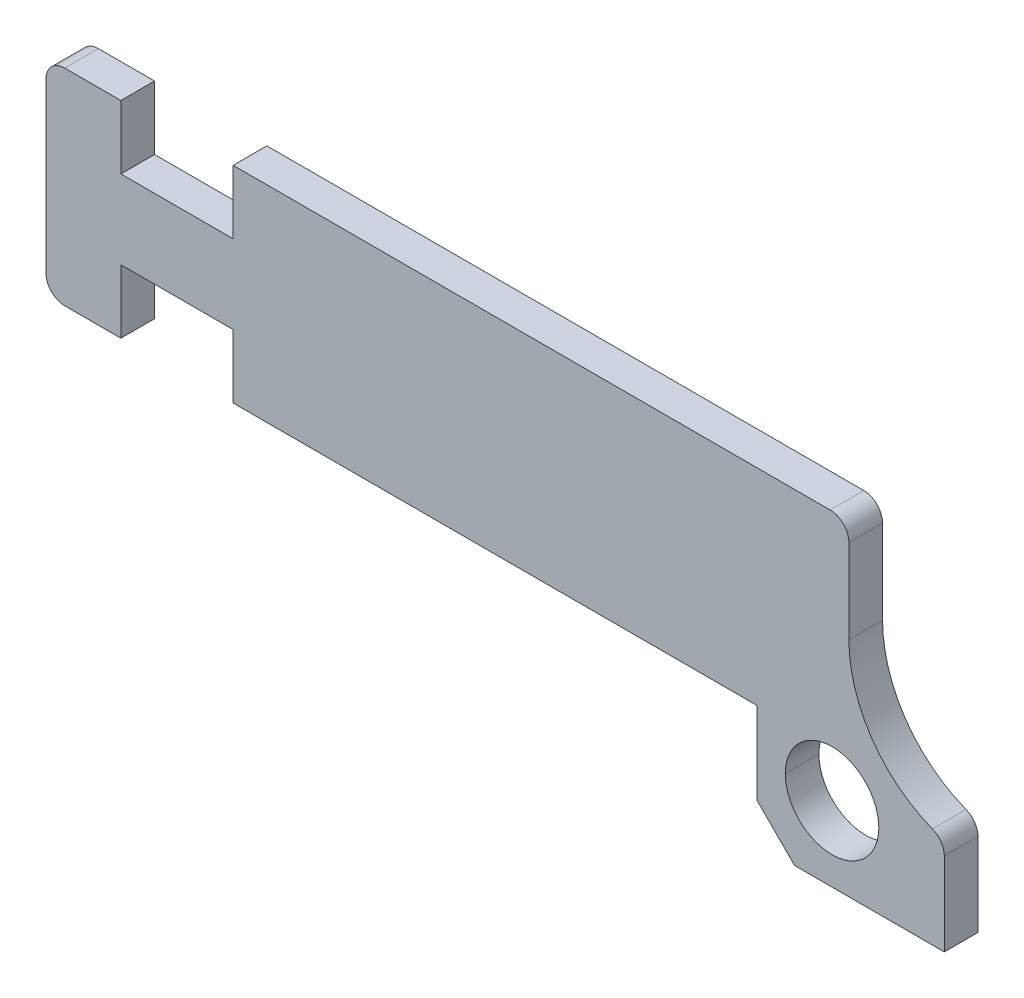
ISO-10303-21;
HEADER;
FILE_DESCRIPTION(('STEP AP214'),'2;1');
FILE_NAME('part.step','',(''),(''),'','','');
FILE_SCHEMA(('AUTOMOTIVE_DESIGN { 1 0 10303 214 1 1 1 1 }'));
ENDSEC;
DATA;
#1=APPLICATION_CONTEXT('core data for automotive mechanical design processes');
#2=APPLICATION_PROTOCOL_DEFINITION('international standard','automotive_design',2000,#1);
#3=PRODUCT_CONTEXT('',#1,'mechanical');
#4=PRODUCT('Part','Part','',(#3));
#5=PRODUCT_RELATED_PRODUCT_CATEGORY('part','',(#4));
#6=PRODUCT_DEFINITION_FORMATION('','',#4);
#7=PRODUCT_DEFINITION_CONTEXT('part definition',#1,'design');
#8=PRODUCT_DEFINITION('design','',#6,#7);
#9=PRODUCT_DEFINITION_SHAPE('','',#8);
#10=(LENGTH_UNIT() NAMED_UNIT(*) SI_UNIT(.MILLI.,.METRE.));
#11=(NAMED_UNIT(*) PLANE_ANGLE_UNIT() SI_UNIT($,.RADIAN.));
#12=(NAMED_UNIT(*) SI_UNIT($,.STERADIAN.) SOLID_ANGLE_UNIT());
#13=UNCERTAINTY_MEASURE_WITH_UNIT(LENGTH_MEASURE(1.E-05),#10,'distance_accuracy_value','');
#14=(GEOMETRIC_REPRESENTATION_CONTEXT(3) GLOBAL_UNCERTAINTY_ASSIGNED_CONTEXT((#13)) GLOBAL_UNIT_ASSIGNED_CONTEXT((#10,
#11,#12)) REPRESENTATION_CONTEXT('',''));
#15=CARTESIAN_POINT('',(0.,0.,0.));
#16=DIRECTION('',(0.,0.,1.));
#17=DIRECTION('',(1.,0.,0.));
#18=AXIS2_PLACEMENT_3D('',#15,#16,#17);
#19=CARTESIAN_POINT('',(-3.95,-3.95,0.9));
#20=DIRECTION('',(0.,0.,1.));
#21=DIRECTION('',(1.,0.,0.));
#22=AXIS2_PLACEMENT_3D('',#19,#20,#21);
#23=CYLINDRICAL_SURFACE('',#22,1.25);
#24=DIRECTION('',(0.,0.,1.));
#25=VECTOR('',#24,1.);
#26=CARTESIAN_POINT('',(-5.2,-3.95,0.9));
#27=LINE('',#26,#25);
#28=CARTESIAN_POINT('',(-5.2,-3.95,0.));
#29=VERTEX_POINT('',#28);
#30=CARTESIAN_POINT('',(-5.2,-3.95,0.9));
#31=VERTEX_POINT('',#30);
#32=EDGE_CURVE('E371',#29,#31,#27,.T.);
#33=ORIENTED_EDGE('',*,*,#32,.F.);
#34=CARTESIAN_POINT('',(-3.95,-3.95,0.));
#35=DIRECTION('',(0.,0.,1.));
#36=DIRECTION('',(1.,0.,0.));
#37=AXIS2_PLACEMENT_3D('',#34,#35,#36);
#38=CIRCLE('',#37,1.25);
#39=CARTESIAN_POINT('',(-2.7,-3.95,0.));
#40=VERTEX_POINT('',#39);
#41=EDGE_CURVE('E324',#40,#29,#38,.T.);
#42=ORIENTED_EDGE('',*,*,#41,.F.);
#43=DIRECTION('',(0.,0.,1.));
#44=VECTOR('',#43,1.);
#45=CARTESIAN_POINT('',(-2.7,-3.95,0.9));
#46=LINE('',#45,#44);
#47=CARTESIAN_POINT('',(-2.7,-3.95,0.9));
#48=VERTEX_POINT('',#47);
#49=EDGE_CURVE('E289',#40,#48,#46,.T.);
#50=ORIENTED_EDGE('',*,*,#49,.T.);
#51=CARTESIAN_POINT('',(-3.95,-3.95,0.9));
#52=DIRECTION('',(0.,0.,1.));
#53=DIRECTION('',(1.,0.,0.));
#54=AXIS2_PLACEMENT_3D('',#51,#52,#53);
#55=CIRCLE('',#54,1.25);
#56=EDGE_CURVE('E11',#48,#31,#55,.T.);
#57=ORIENTED_EDGE('',*,*,#56,.T.);
#58=EDGE_LOOP('',(#33,#42,#50,#57));
#59=FACE_BOUND('',#58,.T.);
#60=ADVANCED_FACE('F17',(#59),#23,.F.);
#61=CARTESIAN_POINT('',(-12.48691210598,-0.852250789584,0.9));
#62=DIRECTION('',(0.,0.,1.));
#63=DIRECTION('',(1.,0.,0.));
#64=AXIS2_PLACEMENT_3D('',#61,#62,#63);
#65=PLANE('',#64);
#66=ORIENTED_EDGE('',*,*,#56,.F.);
#67=CARTESIAN_POINT('',(-3.95,-3.95,0.9));
#68=DIRECTION('',(0.,0.,1.));
#69=DIRECTION('',(1.,0.,0.));
#70=AXIS2_PLACEMENT_3D('',#67,#68,#69);
#71=CIRCLE('',#70,1.25);
#72=EDGE_CURVE('E294',#31,#48,#71,.T.);
#73=ORIENTED_EDGE('',*,*,#72,.F.);
#74=EDGE_LOOP('',(#66,#73));
#75=FACE_BOUND('',#74,.T.);
#76=DIRECTION('',(0.,1.,0.));
#77=VECTOR('',#76,1.);
#78=CARTESIAN_POINT('',(-5.95,-5.95,0.9));
#79=LINE('',#78,#77);
#80=CARTESIAN_POINT('',(-5.95,-4.95,0.9));
#81=VERTEX_POINT('',#80);
#82=CARTESIAN_POINT('',(-5.95,-2.75,0.9));
#83=VERTEX_POINT('',#82);
#84=EDGE_CURVE('E367',#81,#83,#79,.T.);
#85=ORIENTED_EDGE('',*,*,#84,.F.);
#86=DIRECTION('',(0.707106781186548,-0.707106781186548,0.));
#87=VECTOR('',#86,1.);
#88=CARTESIAN_POINT('',(-8.3586653291,-2.5413346709,0.9));
#89=LINE('',#88,#87);
#90=CARTESIAN_POINT('',(-4.95,-5.95,0.9));
#91=VERTEX_POINT('',#90);
#92=EDGE_CURVE('E282',#81,#91,#89,.T.);
#93=ORIENTED_EDGE('',*,*,#92,.T.);
#94=DIRECTION('',(-1.,0.,0.));
#95=VECTOR('',#94,1.);
#96=CARTESIAN_POINT('',(-0.95,-5.95,0.9));
#97=LINE('',#96,#95);
#98=CARTESIAN_POINT('',(-0.95,-5.95,0.9));
#99=VERTEX_POINT('',#98);
#100=EDGE_CURVE('E295',#99,#91,#97,.T.);
#101=ORIENTED_EDGE('',*,*,#100,.F.);
#102=DIRECTION('',(0.,-1.,0.));
#103=VECTOR('',#102,1.);
#104=CARTESIAN_POINT('',(-0.95,-3.727935085272,0.9));
#105=LINE('',#104,#103);
#106=CARTESIAN_POINT('',(-0.95,-3.727935085272,0.9));
#107=VERTEX_POINT('',#106);
#108=EDGE_CURVE('E246',#107,#99,#105,.T.);
#109=ORIENTED_EDGE('',*,*,#108,.F.);
#110=CARTESIAN_POINT('',(-1.45,-3.727935085272,0.9));
#111=DIRECTION('',(0.,0.,1.));
#112=DIRECTION('',(1.,0.,0.));
#113=AXIS2_PLACEMENT_3D('',#110,#111,#112);
#114=CIRCLE('',#113,0.5);
#115=CARTESIAN_POINT('',(-1.26875,-3.261943199613,0.9));
#116=VERTEX_POINT('',#115);
#117=EDGE_CURVE('E242',#107,#116,#114,.T.);
#118=ORIENTED_EDGE('',*,*,#117,.T.);
#119=CARTESIAN_POINT('',(0.,0.,0.9));
#120=DIRECTION('',(0.,0.,1.));
#121=DIRECTION('',(1.,0.,0.));
#122=AXIS2_PLACEMENT_3D('',#119,#120,#121);
#123=CIRCLE('',#122,3.5);
#124=CARTESIAN_POINT('',(-3.5,0.,0.9));
#125=VERTEX_POINT('',#124);
#126=EDGE_CURVE('E303',#125,#116,#123,.T.);
#127=ORIENTED_EDGE('',*,*,#126,.F.);
#128=DIRECTION('',(0.,-1.,0.));
#129=VECTOR('',#128,1.);
#130=CARTESIAN_POINT('',(-3.5,2.25,0.9));
#131=LINE('',#130,#129);
#132=CARTESIAN_POINT('',(-3.5,2.25,0.9));
#133=VERTEX_POINT('',#132);
#134=EDGE_CURVE('E21',#133,#125,#131,.T.);
#135=ORIENTED_EDGE('',*,*,#134,.F.);
#136=CARTESIAN_POINT('',(-4.,2.25,0.9));
#137=DIRECTION('',(0.,0.,1.));
#138=DIRECTION('',(1.,0.,0.));
#139=AXIS2_PLACEMENT_3D('',#136,#137,#138);
#140=CIRCLE('',#139,0.5);
#141=CARTESIAN_POINT('',(-4.,2.75,0.9));
#142=VERTEX_POINT('',#141);
#143=EDGE_CURVE('E309',#133,#142,#140,.T.);
#144=ORIENTED_EDGE('',*,*,#143,.T.);
#145=DIRECTION('',(1.,0.,0.));
#146=VECTOR('',#145,1.);
#147=CARTESIAN_POINT('',(-24.95,2.75,0.9));
#148=LINE('',#147,#146);
#149=CARTESIAN_POINT('',(-19.95,2.75,0.9));
#150=VERTEX_POINT('',#149);
#151=EDGE_CURVE('E397',#150,#142,#148,.T.);
#152=ORIENTED_EDGE('',*,*,#151,.F.);
#153=DIRECTION('',(0.,-1.,0.));
#154=VECTOR('',#153,1.);
#155=CARTESIAN_POINT('',(-19.95,2.75,0.9));
#156=LINE('',#155,#154);
#157=CARTESIAN_POINT('',(-19.95,1.05,0.9));
#158=VERTEX_POINT('',#157);
#159=EDGE_CURVE('E322',#150,#158,#156,.T.);
#160=ORIENTED_EDGE('',*,*,#159,.T.);
#161=DIRECTION('',(-1.,0.,0.));
#162=VECTOR('',#161,1.);
#163=CARTESIAN_POINT('',(-19.95,1.05,0.9));
#164=LINE('',#163,#162);
#165=CARTESIAN_POINT('',(-22.95,1.05,0.9));
#166=VERTEX_POINT('',#165);
#167=EDGE_CURVE('E407',#158,#166,#164,.T.);
#168=ORIENTED_EDGE('',*,*,#167,.T.);
#169=DIRECTION('',(0.,1.,0.));
#170=VECTOR('',#169,1.);
#171=CARTESIAN_POINT('',(-22.95,1.05,0.9));
#172=LINE('',#171,#170);
#173=CARTESIAN_POINT('',(-22.95,2.75,0.9));
#174=VERTEX_POINT('',#173);
#175=EDGE_CURVE('E28',#166,#174,#172,.T.);
#176=ORIENTED_EDGE('',*,*,#175,.T.);
#177=DIRECTION('',(1.,0.,0.));
#178=VECTOR('',#177,1.);
#179=CARTESIAN_POINT('',(-24.95,2.75,0.9));
#180=LINE('',#179,#178);
#181=CARTESIAN_POINT('',(-24.45,2.75,0.9));
#182=VERTEX_POINT('',#181);
#183=EDGE_CURVE('E375',#182,#174,#180,.T.);
#184=ORIENTED_EDGE('',*,*,#183,.F.);
#185=CARTESIAN_POINT('',(-24.45,2.25,0.9));
#186=DIRECTION('',(0.,0.,-1.));
#187=DIRECTION('',(0.,-1.,0.));
#188=AXIS2_PLACEMENT_3D('',#185,#186,#187);
#189=CIRCLE('',#188,0.5);
#190=CARTESIAN_POINT('',(-24.95,2.25,0.9));
#191=VERTEX_POINT('',#190);
#192=EDGE_CURVE('E323',#191,#182,#189,.T.);
#193=ORIENTED_EDGE('',*,*,#192,.F.);
#194=DIRECTION('',(0.,-1.,0.));
#195=VECTOR('',#194,1.);
#196=CARTESIAN_POINT('',(-24.95,2.75,0.9));
#197=LINE('',#196,#195);
#198=CARTESIAN_POINT('',(-24.95,-2.25,0.9));
#199=VERTEX_POINT('',#198);
#200=EDGE_CURVE('E312',#191,#199,#197,.T.);
#201=ORIENTED_EDGE('',*,*,#200,.T.);
#202=CARTESIAN_POINT('',(-24.45,-2.25,0.9));
#203=DIRECTION('',(0.,0.,-1.));
#204=DIRECTION('',(0.,-1.,0.));
#205=AXIS2_PLACEMENT_3D('',#202,#203,#204);
#206=CIRCLE('',#205,0.5);
#207=CARTESIAN_POINT('',(-24.45,-2.75,0.9));
#208=VERTEX_POINT('',#207);
#209=EDGE_CURVE('E386',#208,#199,#206,.T.);
#210=ORIENTED_EDGE('',*,*,#209,.F.);
#211=DIRECTION('',(-1.,0.,0.));
#212=VECTOR('',#211,1.);
#213=CARTESIAN_POINT('',(-5.95,-2.75,0.9));
#214=LINE('',#213,#212);
#215=CARTESIAN_POINT('',(-22.95,-2.75,0.9));
#216=VERTEX_POINT('',#215);
#217=EDGE_CURVE('E308',#216,#208,#214,.T.);
#218=ORIENTED_EDGE('',*,*,#217,.F.);
#219=DIRECTION('',(0.,-1.,0.));
#220=VECTOR('',#219,1.);
#221=CARTESIAN_POINT('',(-22.95,-1.049999999973,0.9));
#222=LINE('',#221,#220);
#223=CARTESIAN_POINT('',(-22.95,-1.049999999973,0.9));
#224=VERTEX_POINT('',#223);
#225=EDGE_CURVE('E304',#224,#216,#222,.T.);
#226=ORIENTED_EDGE('',*,*,#225,.F.);
#227=DIRECTION('',(-1.,0.,0.));
#228=VECTOR('',#227,1.);
#229=CARTESIAN_POINT('',(-19.95,-1.049999999973,0.9));
#230=LINE('',#229,#228);
#231=CARTESIAN_POINT('',(-19.95,-1.049999999973,0.9));
#232=VERTEX_POINT('',#231);
#233=EDGE_CURVE('E354',#232,#224,#230,.T.);
#234=ORIENTED_EDGE('',*,*,#233,.F.);
#235=DIRECTION('',(0.,1.,0.));
#236=VECTOR('',#235,1.);
#237=CARTESIAN_POINT('',(-19.95,-2.75,0.9));
#238=LINE('',#237,#236);
#239=CARTESIAN_POINT('',(-19.95,-2.75,0.9));
#240=VERTEX_POINT('',#239);
#241=EDGE_CURVE('E247',#240,#232,#238,.T.);
#242=ORIENTED_EDGE('',*,*,#241,.F.);
#243=DIRECTION('',(-1.,0.,0.));
#244=VECTOR('',#243,1.);
#245=CARTESIAN_POINT('',(-5.95,-2.75,0.9));
#246=LINE('',#245,#244);
#247=EDGE_CURVE('E277',#83,#240,#246,.T.);
#248=ORIENTED_EDGE('',*,*,#247,.F.);
#249=EDGE_LOOP('',(#85,#93,#101,#109,#118,#127,#135,#144,#152,#160,#168,#176,#184,#193,#201,
#210,#218,#226,#234,#242,#248));
#250=FACE_BOUND('',#249,.T.);
#251=ADVANCED_FACE('F450',(#75,#250),#65,.T.);
#252=CARTESIAN_POINT('',(-22.95,1.05,0.9));
#253=DIRECTION('',(1.,0.,0.));
#254=DIRECTION('',(0.,1.,0.));
#255=AXIS2_PLACEMENT_3D('',#252,#253,#254);
#256=PLANE('',#255);
#257=ORIENTED_EDGE('',*,*,#175,.F.);
#258=DIRECTION('',(0.,0.,-1.));
#259=VECTOR('',#258,1.);
#260=CARTESIAN_POINT('',(-22.95,1.05,0.9));
#261=LINE('',#260,#259);
#262=CARTESIAN_POINT('',(-22.95,1.05,0.));
#263=VERTEX_POINT('',#262);
#264=EDGE_CURVE('E351',#166,#263,#261,.T.);
#265=ORIENTED_EDGE('',*,*,#264,.T.);
#266=DIRECTION('',(0.,1.,0.));
#267=VECTOR('',#266,1.);
#268=CARTESIAN_POINT('',(-22.95,0.09887460520782,0.));
#269=LINE('',#268,#267);
#270=CARTESIAN_POINT('',(-22.95,2.75,0.));
#271=VERTEX_POINT('',#270);
#272=EDGE_CURVE('E429',#263,#271,#269,.T.);
#273=ORIENTED_EDGE('',*,*,#272,.T.);
#274=DIRECTION('',(0.,0.,-1.));
#275=VECTOR('',#274,1.);
#276=CARTESIAN_POINT('',(-22.95,2.75,0.9));
#277=LINE('',#276,#275);
#278=EDGE_CURVE('E404',#174,#271,#277,.T.);
#279=ORIENTED_EDGE('',*,*,#278,.F.);
#280=EDGE_LOOP('',(#257,#265,#273,#279));
#281=FACE_BOUND('',#280,.T.);
#282=ADVANCED_FACE('F464',(#281),#256,.T.);
#283=CARTESIAN_POINT('',(-19.95,1.05,0.9));
#284=DIRECTION('',(0.,1.,0.));
#285=DIRECTION('',(1.,0.,0.));
#286=AXIS2_PLACEMENT_3D('',#283,#284,#285);
#287=PLANE('',#286);
#288=ORIENTED_EDGE('',*,*,#167,.F.);
#289=DIRECTION('',(0.,0.,-1.));
#290=VECTOR('',#289,1.);
#291=CARTESIAN_POINT('',(-19.95,1.05,0.9));
#292=LINE('',#291,#290);
#293=CARTESIAN_POINT('',(-19.95,1.05,0.));
#294=VERTEX_POINT('',#293);
#295=EDGE_CURVE('E372',#158,#294,#292,.T.);
#296=ORIENTED_EDGE('',*,*,#295,.T.);
#297=DIRECTION('',(-1.,0.,0.));
#298=VECTOR('',#297,1.);
#299=CARTESIAN_POINT('',(-16.21845605299,1.05,0.));
#300=LINE('',#299,#298);
#301=EDGE_CURVE('E432',#294,#263,#300,.T.);
#302=ORIENTED_EDGE('',*,*,#301,.T.);
#303=ORIENTED_EDGE('',*,*,#264,.F.);
#304=EDGE_LOOP('',(#288,#296,#302,#303));
#305=FACE_BOUND('',#304,.T.);
#306=ADVANCED_FACE('F462',(#305),#287,.T.);
#307=CARTESIAN_POINT('',(-24.95,2.75,0.));
#308=DIRECTION('',(0.,1.,0.));
#309=DIRECTION('',(1.,0.,0.));
#310=AXIS2_PLACEMENT_3D('',#307,#308,#309);
#311=PLANE('',#310);
#312=DIRECTION('',(1.,0.,0.));
#313=VECTOR('',#312,1.);
#314=CARTESIAN_POINT('',(-24.95,2.75,0.));
#315=LINE('',#314,#313);
#316=CARTESIAN_POINT('',(-24.45,2.75,0.));
#317=VERTEX_POINT('',#316);
#318=EDGE_CURVE('E380',#317,#271,#315,.T.);
#319=ORIENTED_EDGE('',*,*,#318,.F.);
#320=DIRECTION('',(0.,0.,1.));
#321=VECTOR('',#320,1.);
#322=CARTESIAN_POINT('',(-24.45,2.75,0.));
#323=LINE('',#322,#321);
#324=EDGE_CURVE('E318',#317,#182,#323,.T.);
#325=ORIENTED_EDGE('',*,*,#324,.T.);
#326=ORIENTED_EDGE('',*,*,#183,.T.);
#327=ORIENTED_EDGE('',*,*,#278,.T.);
#328=EDGE_LOOP('',(#319,#325,#326,#327));
#329=FACE_BOUND('',#328,.T.);
#330=ADVANCED_FACE('F834',(#329),#311,.T.);
#331=CARTESIAN_POINT('',(-19.95,2.75,0.9));
#332=DIRECTION('',(-1.,0.,0.));
#333=DIRECTION('',(0.,0.,1.));
#334=AXIS2_PLACEMENT_3D('',#331,#332,#333);
#335=PLANE('',#334);
#336=ORIENTED_EDGE('',*,*,#159,.F.);
#337=DIRECTION('',(0.,0.,-1.));
#338=VECTOR('',#337,1.);
#339=CARTESIAN_POINT('',(-19.95,2.75,0.9));
#340=LINE('',#339,#338);
#341=CARTESIAN_POINT('',(-19.95,2.75,0.));
#342=VERTEX_POINT('',#341);
#343=EDGE_CURVE('E274',#150,#342,#340,.T.);
#344=ORIENTED_EDGE('',*,*,#343,.T.);
#345=DIRECTION('',(0.,-1.,0.));
#346=VECTOR('',#345,1.);
#347=CARTESIAN_POINT('',(-19.95,0.948874605208,0.));
#348=LINE('',#347,#346);
#349=EDGE_CURVE('E458',#342,#294,#348,.T.);
#350=ORIENTED_EDGE('',*,*,#349,.T.);
#351=ORIENTED_EDGE('',*,*,#295,.F.);
#352=EDGE_LOOP('',(#336,#344,#350,#351));
#353=FACE_BOUND('',#352,.T.);
#354=ADVANCED_FACE('F454',(#353),#335,.T.);
#355=CARTESIAN_POINT('',(-24.45,2.25,0.));
#356=DIRECTION('',(0.,0.,1.));
#357=DIRECTION('',(-1.,0.,0.));
#358=AXIS2_PLACEMENT_3D('',#355,#356,#357);
#359=CYLINDRICAL_SURFACE('',#358,0.5);
#360=DIRECTION('',(0.,0.,1.));
#361=VECTOR('',#360,1.);
#362=CARTESIAN_POINT('',(-24.95,2.25,0.));
#363=LINE('',#362,#361);
#364=CARTESIAN_POINT('',(-24.95,2.25,0.));
#365=VERTEX_POINT('',#364);
#366=EDGE_CURVE('E317',#365,#191,#363,.T.);
#367=ORIENTED_EDGE('',*,*,#366,.T.);
#368=ORIENTED_EDGE('',*,*,#192,.T.);
#369=ORIENTED_EDGE('',*,*,#324,.F.);
#370=CARTESIAN_POINT('',(-24.45,2.25,0.));
#371=DIRECTION('',(0.,0.,-1.));
#372=DIRECTION('',(0.,-1.,0.));
#373=AXIS2_PLACEMENT_3D('',#370,#371,#372);
#374=CIRCLE('',#373,0.5);
#375=EDGE_CURVE('E376',#365,#317,#374,.T.);
#376=ORIENTED_EDGE('',*,*,#375,.F.);
#377=EDGE_LOOP('',(#367,#368,#369,#376));
#378=FACE_BOUND('',#377,.T.);
#379=ADVANCED_FACE('F715',(#378),#359,.T.);
#380=CARTESIAN_POINT('',(-24.95,2.75,0.));
#381=DIRECTION('',(0.,1.,0.));
#382=DIRECTION('',(1.,0.,0.));
#383=AXIS2_PLACEMENT_3D('',#380,#381,#382);
#384=PLANE('',#383);
#385=DIRECTION('',(1.,0.,0.));
#386=VECTOR('',#385,1.);
#387=CARTESIAN_POINT('',(-24.95,2.75,0.));
#388=LINE('',#387,#386);
#389=CARTESIAN_POINT('',(-4.,2.75,0.));
#390=VERTEX_POINT('',#389);
#391=EDGE_CURVE('E422',#342,#390,#388,.T.);
#392=ORIENTED_EDGE('',*,*,#391,.F.);
#393=ORIENTED_EDGE('',*,*,#343,.F.);
#394=ORIENTED_EDGE('',*,*,#151,.T.);
#395=DIRECTION('',(0.,0.,1.));
#396=VECTOR('',#395,1.);
#397=CARTESIAN_POINT('',(-4.,2.75,0.));
#398=LINE('',#397,#396);
#399=EDGE_CURVE('E313',#390,#142,#398,.T.);
#400=ORIENTED_EDGE('',*,*,#399,.F.);
#401=EDGE_LOOP('',(#392,#393,#394,#400));
#402=FACE_BOUND('',#401,.T.);
#403=ADVANCED_FACE('F710',(#402),#384,.T.);
#404=CARTESIAN_POINT('',(-24.95,2.75,0.));
#405=DIRECTION('',(1.,0.,0.));
#406=DIRECTION('',(0.,1.,0.));
#407=AXIS2_PLACEMENT_3D('',#404,#405,#406);
#408=PLANE('',#407);
#409=DIRECTION('',(0.,0.,1.));
#410=VECTOR('',#409,1.);
#411=CARTESIAN_POINT('',(-24.95,-2.25,0.));
#412=LINE('',#411,#410);
#413=CARTESIAN_POINT('',(-24.95,-2.25,0.));
#414=VERTEX_POINT('',#413);
#415=EDGE_CURVE('E382',#414,#199,#412,.T.);
#416=ORIENTED_EDGE('',*,*,#415,.T.);
#417=ORIENTED_EDGE('',*,*,#200,.F.);
#418=ORIENTED_EDGE('',*,*,#366,.F.);
#419=DIRECTION('',(0.,-1.,0.));
#420=VECTOR('',#419,1.);
#421=CARTESIAN_POINT('',(-24.95,2.75,0.));
#422=LINE('',#421,#420);
#423=EDGE_CURVE('E381',#365,#414,#422,.T.);
#424=ORIENTED_EDGE('',*,*,#423,.T.);
#425=EDGE_LOOP('',(#416,#417,#418,#424));
#426=FACE_BOUND('',#425,.T.);
#427=ADVANCED_FACE('F714',(#426),#408,.F.);
#428=CARTESIAN_POINT('',(-4.,2.25,0.));
#429=DIRECTION('',(0.,0.,-1.));
#430=DIRECTION('',(1.,0.,0.));
#431=AXIS2_PLACEMENT_3D('',#428,#429,#430);
#432=CYLINDRICAL_SURFACE('',#431,0.5);
#433=CARTESIAN_POINT('',(-4.,2.25,0.));
#434=DIRECTION('',(0.,0.,1.));
#435=DIRECTION('',(1.,0.,0.));
#436=AXIS2_PLACEMENT_3D('',#433,#434,#435);
#437=CIRCLE('',#436,0.5);
#438=CARTESIAN_POINT('',(-3.5,2.25,0.));
#439=VERTEX_POINT('',#438);
#440=EDGE_CURVE('E418',#439,#390,#437,.T.);
#441=ORIENTED_EDGE('',*,*,#440,.T.);
#442=ORIENTED_EDGE('',*,*,#399,.T.);
#443=ORIENTED_EDGE('',*,*,#143,.F.);
#444=DIRECTION('',(0.,0.,1.));
#445=VECTOR('',#444,1.);
#446=CARTESIAN_POINT('',(-3.5,2.25,0.));
#447=LINE('',#446,#445);
#448=EDGE_CURVE('E348',#439,#133,#447,.T.);
#449=ORIENTED_EDGE('',*,*,#448,.F.);
#450=EDGE_LOOP('',(#441,#442,#443,#449));
#451=FACE_BOUND('',#450,.T.);
#452=ADVANCED_FACE('F764',(#451),#432,.T.);
#453=CARTESIAN_POINT('',(-24.45,-2.25,0.));
#454=DIRECTION('',(0.,0.,1.));
#455=DIRECTION('',(0.,-1.,0.));
#456=AXIS2_PLACEMENT_3D('',#453,#454,#455);
#457=CYLINDRICAL_SURFACE('',#456,0.5);
#458=DIRECTION('',(0.,0.,1.));
#459=VECTOR('',#458,1.);
#460=CARTESIAN_POINT('',(-24.45,-2.75,0.));
#461=LINE('',#460,#459);
#462=CARTESIAN_POINT('',(-24.45,-2.75,0.));
#463=VERTEX_POINT('',#462);
#464=EDGE_CURVE('E214',#463,#208,#461,.T.);
#465=ORIENTED_EDGE('',*,*,#464,.T.);
#466=ORIENTED_EDGE('',*,*,#209,.T.);
#467=ORIENTED_EDGE('',*,*,#415,.F.);
#468=CARTESIAN_POINT('',(-24.45,-2.25,0.));
#469=DIRECTION('',(0.,0.,-1.));
#470=DIRECTION('',(0.,-1.,0.));
#471=AXIS2_PLACEMENT_3D('',#468,#469,#470);
#472=CIRCLE('',#471,0.5);
#473=EDGE_CURVE('E437',#463,#414,#472,.T.);
#474=ORIENTED_EDGE('',*,*,#473,.F.);
#475=EDGE_LOOP('',(#465,#466,#467,#474));
#476=FACE_BOUND('',#475,.T.);
#477=ADVANCED_FACE('F768',(#476),#457,.T.);
#478=CARTESIAN_POINT('',(-3.5,2.25,0.));
#479=DIRECTION('',(1.,0.,0.));
#480=DIRECTION('',(0.,1.,0.));
#481=AXIS2_PLACEMENT_3D('',#478,#479,#480);
#482=PLANE('',#481);
#483=ORIENTED_EDGE('',*,*,#448,.T.);
#484=ORIENTED_EDGE('',*,*,#134,.T.);
#485=DIRECTION('',(0.,0.,1.));
#486=VECTOR('',#485,1.);
#487=CARTESIAN_POINT('',(-3.5,0.,0.));
#488=LINE('',#487,#486);
#489=CARTESIAN_POINT('',(-3.5,0.,0.));
#490=VERTEX_POINT('',#489);
#491=EDGE_CURVE('E299',#490,#125,#488,.T.);
#492=ORIENTED_EDGE('',*,*,#491,.F.);
#493=DIRECTION('',(0.,-1.,0.));
#494=VECTOR('',#493,1.);
#495=CARTESIAN_POINT('',(-3.5,2.25,0.));
#496=LINE('',#495,#494);
#497=EDGE_CURVE('E271',#439,#490,#496,.T.);
#498=ORIENTED_EDGE('',*,*,#497,.F.);
#499=EDGE_LOOP('',(#483,#484,#492,#498));
#500=FACE_BOUND('',#499,.T.);
#501=ADVANCED_FACE('F774',(#500),#482,.T.);
#502=CARTESIAN_POINT('',(-5.95,-2.75,0.));
#503=DIRECTION('',(0.,-1.,0.));
#504=DIRECTION('',(0.,0.,-1.));
#505=AXIS2_PLACEMENT_3D('',#502,#503,#504);
#506=PLANE('',#505);
#507=DIRECTION('',(-1.,0.,0.));
#508=VECTOR('',#507,1.);
#509=CARTESIAN_POINT('',(-5.95,-2.75,0.));
#510=LINE('',#509,#508);
#511=CARTESIAN_POINT('',(-22.95,-2.75,0.));
#512=VERTEX_POINT('',#511);
#513=EDGE_CURVE('E287',#512,#463,#510,.T.);
#514=ORIENTED_EDGE('',*,*,#513,.F.);
#515=DIRECTION('',(0.,0.,-1.));
#516=VECTOR('',#515,1.);
#517=CARTESIAN_POINT('',(-22.95,-2.75,0.9));
#518=LINE('',#517,#516);
#519=EDGE_CURVE('E202',#216,#512,#518,.T.);
#520=ORIENTED_EDGE('',*,*,#519,.F.);
#521=ORIENTED_EDGE('',*,*,#217,.T.);
#522=ORIENTED_EDGE('',*,*,#464,.F.);
#523=EDGE_LOOP('',(#514,#520,#521,#522));
#524=FACE_BOUND('',#523,.T.);
#525=ADVANCED_FACE('F750',(#524),#506,.T.);
#526=CARTESIAN_POINT('',(0.,0.,0.));
#527=DIRECTION('',(0.,0.,-1.));
#528=DIRECTION('',(1.,0.,0.));
#529=AXIS2_PLACEMENT_3D('',#526,#527,#528);
#530=CYLINDRICAL_SURFACE('',#529,3.5);
#531=ORIENTED_EDGE('',*,*,#491,.T.);
#532=ORIENTED_EDGE('',*,*,#126,.T.);
#533=DIRECTION('',(0.,0.,1.));
#534=VECTOR('',#533,1.);
#535=CARTESIAN_POINT('',(-1.26875,-3.261943199613,0.));
#536=LINE('',#535,#534);
#537=CARTESIAN_POINT('',(-1.26875,-3.261943199613,0.));
#538=VERTEX_POINT('',#537);
#539=EDGE_CURVE('E336',#538,#116,#536,.T.);
#540=ORIENTED_EDGE('',*,*,#539,.F.);
#541=CARTESIAN_POINT('',(0.,0.,0.));
#542=DIRECTION('',(0.,0.,1.));
#543=DIRECTION('',(1.,0.,0.));
#544=AXIS2_PLACEMENT_3D('',#541,#542,#543);
#545=CIRCLE('',#544,3.5);
#546=EDGE_CURVE('E264',#490,#538,#545,.T.);
#547=ORIENTED_EDGE('',*,*,#546,.F.);
#548=EDGE_LOOP('',(#531,#532,#540,#547));
#549=FACE_BOUND('',#548,.T.);
#550=ADVANCED_FACE('F745',(#549),#530,.F.);
#551=CARTESIAN_POINT('',(-22.95,-1.049999999973,0.9));
#552=DIRECTION('',(-1.,0.,0.));
#553=DIRECTION('',(0.,0.,1.));
#554=AXIS2_PLACEMENT_3D('',#551,#552,#553);
#555=PLANE('',#554);
#556=ORIENTED_EDGE('',*,*,#519,.T.);
#557=DIRECTION('',(0.,-1.,0.));
#558=VECTOR('',#557,1.);
#559=CARTESIAN_POINT('',(-22.95,-0.951125394779,0.));
#560=LINE('',#559,#558);
#561=CARTESIAN_POINT('',(-22.95,-1.049999999973,0.));
#562=VERTEX_POINT('',#561);
#563=EDGE_CURVE('E283',#562,#512,#560,.T.);
#564=ORIENTED_EDGE('',*,*,#563,.F.);
#565=DIRECTION('',(0.,0.,-1.));
#566=VECTOR('',#565,1.);
#567=CARTESIAN_POINT('',(-22.95,-1.049999999973,0.9));
#568=LINE('',#567,#566);
#569=EDGE_CURVE('E333',#224,#562,#568,.T.);
#570=ORIENTED_EDGE('',*,*,#569,.F.);
#571=ORIENTED_EDGE('',*,*,#225,.T.);
#572=EDGE_LOOP('',(#556,#564,#570,#571));
#573=FACE_BOUND('',#572,.T.);
#574=ADVANCED_FACE('F749',(#573),#555,.F.);
#575=CARTESIAN_POINT('',(-1.45,-3.727935085272,0.));
#576=DIRECTION('',(0.,0.,-1.));
#577=DIRECTION('',(1.,0.,0.));
#578=AXIS2_PLACEMENT_3D('',#575,#576,#577);
#579=CYLINDRICAL_SURFACE('',#578,0.5);
#580=CARTESIAN_POINT('',(-1.45,-3.727935085272,0.));
#581=DIRECTION('',(0.,0.,1.));
#582=DIRECTION('',(1.,0.,0.));
#583=AXIS2_PLACEMENT_3D('',#580,#581,#582);
#584=CIRCLE('',#583,0.5);
#585=CARTESIAN_POINT('',(-0.95,-3.727935085272,0.));
#586=VERTEX_POINT('',#585);
#587=EDGE_CURVE('E239',#586,#538,#584,.T.);
#588=ORIENTED_EDGE('',*,*,#587,.T.);
#589=ORIENTED_EDGE('',*,*,#539,.T.);
#590=ORIENTED_EDGE('',*,*,#117,.F.);
#591=DIRECTION('',(0.,0.,1.));
#592=VECTOR('',#591,1.);
#593=CARTESIAN_POINT('',(-0.95,-3.727935085272,0.));
#594=LINE('',#593,#592);
#595=EDGE_CURVE('E234',#586,#107,#594,.T.);
#596=ORIENTED_EDGE('',*,*,#595,.F.);
#597=EDGE_LOOP('',(#588,#589,#590,#596));
#598=FACE_BOUND('',#597,.T.);
#599=ADVANCED_FACE('F236',(#598),#579,.T.);
#600=CARTESIAN_POINT('',(-19.95,-1.049999999973,0.9));
#601=DIRECTION('',(0.,1.,0.));
#602=DIRECTION('',(1.,0.,0.));
#603=AXIS2_PLACEMENT_3D('',#600,#601,#602);
#604=PLANE('',#603);
#605=ORIENTED_EDGE('',*,*,#569,.T.);
#606=DIRECTION('',(-1.,0.,0.));
#607=VECTOR('',#606,1.);
#608=CARTESIAN_POINT('',(-16.21845605299,-1.049999999973,0.));
#609=LINE('',#608,#607);
#610=CARTESIAN_POINT('',(-19.95,-1.049999999973,0.));
#611=VERTEX_POINT('',#610);
#612=EDGE_CURVE('E288',#611,#562,#609,.T.);
#613=ORIENTED_EDGE('',*,*,#612,.F.);
#614=DIRECTION('',(0.,0.,-1.));
#615=VECTOR('',#614,1.);
#616=CARTESIAN_POINT('',(-19.95,-1.049999999973,0.9));
#617=LINE('',#616,#615);
#618=EDGE_CURVE('E298',#232,#611,#617,.T.);
#619=ORIENTED_EDGE('',*,*,#618,.F.);
#620=ORIENTED_EDGE('',*,*,#233,.T.);
#621=EDGE_LOOP('',(#605,#613,#619,#620));
#622=FACE_BOUND('',#621,.T.);
#623=ADVANCED_FACE('F783',(#622),#604,.F.);
#624=CARTESIAN_POINT('',(-0.95,-3.727935085272,0.));
#625=DIRECTION('',(1.,0.,0.));
#626=DIRECTION('',(0.,1.,0.));
#627=AXIS2_PLACEMENT_3D('',#624,#625,#626);
#628=PLANE('',#627);
#629=ORIENTED_EDGE('',*,*,#595,.T.);
#630=ORIENTED_EDGE('',*,*,#108,.T.);
#631=DIRECTION('',(0.,0.,1.));
#632=VECTOR('',#631,1.);
#633=CARTESIAN_POINT('',(-0.95,-5.95,0.));
#634=LINE('',#633,#632);
#635=CARTESIAN_POINT('',(-0.95,-5.95,0.));
#636=VERTEX_POINT('',#635);
#637=EDGE_CURVE('E253',#636,#99,#634,.T.);
#638=ORIENTED_EDGE('',*,*,#637,.F.);
#639=DIRECTION('',(0.,-1.,0.));
#640=VECTOR('',#639,1.);
#641=CARTESIAN_POINT('',(-0.95,-3.727935085272,0.));
#642=LINE('',#641,#640);
#643=EDGE_CURVE('E250',#586,#636,#642,.T.);
#644=ORIENTED_EDGE('',*,*,#643,.F.);
#645=EDGE_LOOP('',(#629,#630,#638,#644));
#646=FACE_BOUND('',#645,.T.);
#647=ADVANCED_FACE('F251',(#646),#628,.T.);
#648=CARTESIAN_POINT('',(-19.95,-2.75,0.9));
#649=DIRECTION('',(1.,0.,0.));
#650=DIRECTION('',(0.,1.,0.));
#651=AXIS2_PLACEMENT_3D('',#648,#649,#650);
#652=PLANE('',#651);
#653=ORIENTED_EDGE('',*,*,#618,.T.);
#654=DIRECTION('',(0.,1.,0.));
#655=VECTOR('',#654,1.);
#656=CARTESIAN_POINT('',(-19.95,-1.801125394792,0.));
#657=LINE('',#656,#655);
#658=CARTESIAN_POINT('',(-19.95,-2.75,0.));
#659=VERTEX_POINT('',#658);
#660=EDGE_CURVE('E337',#659,#611,#657,.T.);
#661=ORIENTED_EDGE('',*,*,#660,.F.);
#662=DIRECTION('',(0.,0.,-1.));
#663=VECTOR('',#662,1.);
#664=CARTESIAN_POINT('',(-19.95,-2.75,0.9));
#665=LINE('',#664,#663);
#666=EDGE_CURVE('E281',#240,#659,#665,.T.);
#667=ORIENTED_EDGE('',*,*,#666,.F.);
#668=ORIENTED_EDGE('',*,*,#241,.T.);
#669=EDGE_LOOP('',(#653,#661,#667,#668));
#670=FACE_BOUND('',#669,.T.);
#671=ADVANCED_FACE('F818',(#670),#652,.F.);
#672=CARTESIAN_POINT('',(-0.95,-5.95,0.));
#673=DIRECTION('',(0.,-1.,0.));
#674=DIRECTION('',(0.,0.,-1.));
#675=AXIS2_PLACEMENT_3D('',#672,#673,#674);
#676=PLANE('',#675);
#677=DIRECTION('',(-1.,0.,0.));
#678=VECTOR('',#677,1.);
#679=CARTESIAN_POINT('',(-0.95,-5.95,0.));
#680=LINE('',#679,#678);
#681=CARTESIAN_POINT('',(-4.95,-5.95,0.));
#682=VERTEX_POINT('',#681);
#683=EDGE_CURVE('E258',#636,#682,#680,.T.);
#684=ORIENTED_EDGE('',*,*,#683,.F.);
#685=ORIENTED_EDGE('',*,*,#637,.T.);
#686=ORIENTED_EDGE('',*,*,#100,.T.);
#687=DIRECTION('',(0.,0.,1.));
#688=VECTOR('',#687,1.);
#689=CARTESIAN_POINT('',(-4.95,-5.95,0.));
#690=LINE('',#689,#688);
#691=EDGE_CURVE('E357',#682,#91,#690,.T.);
#692=ORIENTED_EDGE('',*,*,#691,.F.);
#693=EDGE_LOOP('',(#684,#685,#686,#692));
#694=FACE_BOUND('',#693,.T.);
#695=ADVANCED_FACE('F19',(#694),#676,.T.);
#696=CARTESIAN_POINT('',(-5.95,-2.75,0.));
#697=DIRECTION('',(0.,-1.,0.));
#698=DIRECTION('',(0.,0.,-1.));
#699=AXIS2_PLACEMENT_3D('',#696,#697,#698);
#700=PLANE('',#699);
#701=DIRECTION('',(-1.,0.,0.));
#702=VECTOR('',#701,1.);
#703=CARTESIAN_POINT('',(-5.95,-2.75,0.));
#704=LINE('',#703,#702);
#705=CARTESIAN_POINT('',(-5.95,-2.75,0.));
#706=VERTEX_POINT('',#705);
#707=EDGE_CURVE('E293',#706,#659,#704,.T.);
#708=ORIENTED_EDGE('',*,*,#707,.F.);
#709=DIRECTION('',(0.,0.,1.));
#710=VECTOR('',#709,1.);
#711=CARTESIAN_POINT('',(-5.95,-2.75,0.));
#712=LINE('',#711,#710);
#713=EDGE_CURVE('E361',#706,#83,#712,.T.);
#714=ORIENTED_EDGE('',*,*,#713,.T.);
#715=ORIENTED_EDGE('',*,*,#247,.T.);
#716=ORIENTED_EDGE('',*,*,#666,.T.);
#717=EDGE_LOOP('',(#708,#714,#715,#716));
#718=FACE_BOUND('',#717,.T.);
#719=ADVANCED_FACE('F492',(#718),#700,.T.);
#720=CARTESIAN_POINT('',(-5.45,-5.45,0.));
#721=DIRECTION('',(-0.707106781186548,-0.707106781186548,0.));
#722=DIRECTION('',(-0.707106781186548,0.707106781186548,0.));
#723=AXIS2_PLACEMENT_3D('',#720,#721,#722);
#724=PLANE('',#723);
#725=ORIENTED_EDGE('',*,*,#691,.T.);
#726=ORIENTED_EDGE('',*,*,#92,.F.);
#727=DIRECTION('',(0.,0.,1.));
#728=VECTOR('',#727,1.);
#729=CARTESIAN_POINT('',(-5.95,-4.95,0.));
#730=LINE('',#729,#728);
#731=CARTESIAN_POINT('',(-5.95,-4.95,0.));
#732=VERTEX_POINT('',#731);
#733=EDGE_CURVE('E327',#732,#81,#730,.T.);
#734=ORIENTED_EDGE('',*,*,#733,.F.);
#735=DIRECTION('',(0.707106781186548,-0.707106781186548,0.));
#736=VECTOR('',#735,1.);
#737=CARTESIAN_POINT('',(-8.3586653291,-2.5413346709,0.));
#738=LINE('',#737,#736);
#739=EDGE_CURVE('E497',#732,#682,#738,.T.);
#740=ORIENTED_EDGE('',*,*,#739,.T.);
#741=EDGE_LOOP('',(#725,#726,#734,#740));
#742=FACE_BOUND('',#741,.T.);
#743=ADVANCED_FACE('F740',(#742),#724,.T.);
#744=CARTESIAN_POINT('',(-5.95,-5.95,0.));
#745=DIRECTION('',(-1.,0.,0.));
#746=DIRECTION('',(0.,0.,1.));
#747=AXIS2_PLACEMENT_3D('',#744,#745,#746);
#748=PLANE('',#747);
#749=DIRECTION('',(0.,1.,0.));
#750=VECTOR('',#749,1.);
#751=CARTESIAN_POINT('',(-5.95,-5.95,0.));
#752=LINE('',#751,#750);
#753=EDGE_CURVE('E328',#732,#706,#752,.T.);
#754=ORIENTED_EDGE('',*,*,#753,.F.);
#755=ORIENTED_EDGE('',*,*,#733,.T.);
#756=ORIENTED_EDGE('',*,*,#84,.T.);
#757=ORIENTED_EDGE('',*,*,#713,.F.);
#758=EDGE_LOOP('',(#754,#755,#756,#757));
#759=FACE_BOUND('',#758,.T.);
#760=ADVANCED_FACE('F486',(#759),#748,.T.);
#761=CARTESIAN_POINT('',(-12.48691210598,-0.852250789584,0.));
#762=DIRECTION('',(0.,0.,1.));
#763=DIRECTION('',(1.,0.,0.));
#764=AXIS2_PLACEMENT_3D('',#761,#762,#763);
#765=PLANE('',#764);
#766=ORIENTED_EDGE('',*,*,#41,.T.);
#767=CARTESIAN_POINT('',(-3.95,-3.95,0.));
#768=DIRECTION('',(0.,0.,1.));
#769=DIRECTION('',(1.,0.,0.));
#770=AXIS2_PLACEMENT_3D('',#767,#768,#769);
#771=CIRCLE('',#770,1.25);
#772=EDGE_CURVE('E387',#29,#40,#771,.T.);
#773=ORIENTED_EDGE('',*,*,#772,.T.);
#774=EDGE_LOOP('',(#766,#773));
#775=FACE_BOUND('',#774,.T.);
#776=ORIENTED_EDGE('',*,*,#707,.T.);
#777=ORIENTED_EDGE('',*,*,#660,.T.);
#778=ORIENTED_EDGE('',*,*,#612,.T.);
#779=ORIENTED_EDGE('',*,*,#563,.T.);
#780=ORIENTED_EDGE('',*,*,#513,.T.);
#781=ORIENTED_EDGE('',*,*,#473,.T.);
#782=ORIENTED_EDGE('',*,*,#423,.F.);
#783=ORIENTED_EDGE('',*,*,#375,.T.);
#784=ORIENTED_EDGE('',*,*,#318,.T.);
#785=ORIENTED_EDGE('',*,*,#272,.F.);
#786=ORIENTED_EDGE('',*,*,#301,.F.);
#787=ORIENTED_EDGE('',*,*,#349,.F.);
#788=ORIENTED_EDGE('',*,*,#391,.T.);
#789=ORIENTED_EDGE('',*,*,#440,.F.);
#790=ORIENTED_EDGE('',*,*,#497,.T.);
#791=ORIENTED_EDGE('',*,*,#546,.T.);
#792=ORIENTED_EDGE('',*,*,#587,.F.);
#793=ORIENTED_EDGE('',*,*,#643,.T.);
#794=ORIENTED_EDGE('',*,*,#683,.T.);
#795=ORIENTED_EDGE('',*,*,#739,.F.);
#796=ORIENTED_EDGE('',*,*,#753,.T.);
#797=EDGE_LOOP('',(#776,#777,#778,#779,#780,#781,#782,#783,#784,#785,#786,#787,#788,#789,#790,
#791,#792,#793,#794,#795,#796));
#798=FACE_BOUND('',#797,.T.);
#799=ADVANCED_FACE('F261',(#775,#798),#765,.F.);
#800=CARTESIAN_POINT('',(-3.95,-3.95,0.9));
#801=DIRECTION('',(0.,0.,1.));
#802=DIRECTION('',(1.,0.,0.));
#803=AXIS2_PLACEMENT_3D('',#800,#801,#802);
#804=CYLINDRICAL_SURFACE('',#803,1.25);
#805=ORIENTED_EDGE('',*,*,#772,.F.);
#806=ORIENTED_EDGE('',*,*,#32,.T.);
#807=ORIENTED_EDGE('',*,*,#72,.T.);
#808=ORIENTED_EDGE('',*,*,#49,.F.);
#809=EDGE_LOOP('',(#805,#806,#807,#808));
#810=FACE_BOUND('',#809,.T.);
#811=ADVANCED_FACE('F704',(#810),#804,.F.);
#812=CLOSED_SHELL('',(#60,#251,#282,#306,#330,#354,#379,#403,#427,#452,#477,#501,#525,#550,#574,
#599,#623,#647,#671,#695,#719,#743,#760,#799,#811));
#813=MANIFOLD_SOLID_BREP('B1',#812);
#814=ADVANCED_BREP_SHAPE_REPRESENTATION('',(#18,#813),#14);
#815=SHAPE_DEFINITION_REPRESENTATION(#9,#814);
ENDSEC;
END-ISO-10303-21;
